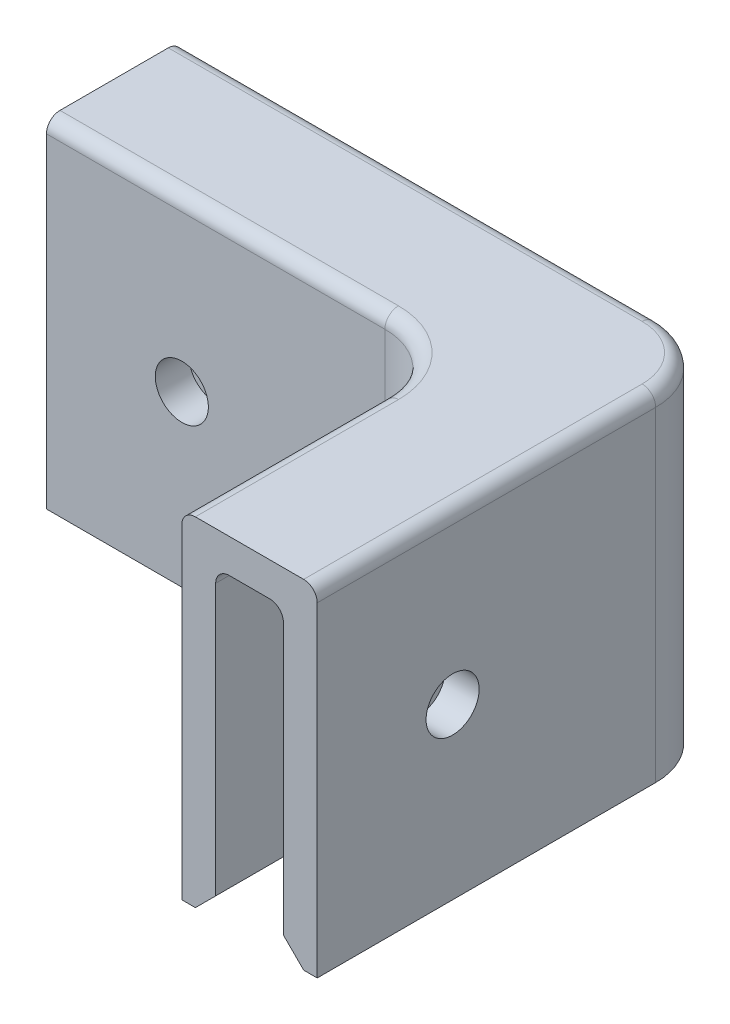
ISO-10303-21;
HEADER;
FILE_DESCRIPTION(('STEP AP214'),'2;1');
FILE_NAME('part.step','',(''),(''),'','','');
FILE_SCHEMA(('AUTOMOTIVE_DESIGN { 1 0 10303 214 1 1 1 1 }'));
ENDSEC;
DATA;
#1=APPLICATION_CONTEXT('core data for automotive mechanical design processes');
#2=APPLICATION_PROTOCOL_DEFINITION('international standard','automotive_design',2000,#1);
#3=PRODUCT_CONTEXT('',#1,'mechanical');
#4=PRODUCT('Part','Part','',(#3));
#5=PRODUCT_RELATED_PRODUCT_CATEGORY('part','',(#4));
#6=PRODUCT_DEFINITION_FORMATION('','',#4);
#7=PRODUCT_DEFINITION_CONTEXT('part definition',#1,'design');
#8=PRODUCT_DEFINITION('design','',#6,#7);
#9=PRODUCT_DEFINITION_SHAPE('','',#8);
#10=(LENGTH_UNIT() NAMED_UNIT(*) SI_UNIT(.MILLI.,.METRE.));
#11=(NAMED_UNIT(*) PLANE_ANGLE_UNIT() SI_UNIT($,.RADIAN.));
#12=(NAMED_UNIT(*) SI_UNIT($,.STERADIAN.) SOLID_ANGLE_UNIT());
#13=UNCERTAINTY_MEASURE_WITH_UNIT(LENGTH_MEASURE(1.E-05),#10,'distance_accuracy_value','');
#14=(GEOMETRIC_REPRESENTATION_CONTEXT(3) GLOBAL_UNCERTAINTY_ASSIGNED_CONTEXT((#13)) GLOBAL_UNIT_ASSIGNED_CONTEXT((#10,
#11,#12)) REPRESENTATION_CONTEXT('',''));
#15=CARTESIAN_POINT('',(0.,0.,0.));
#16=DIRECTION('',(0.,0.,1.));
#17=DIRECTION('',(1.,0.,0.));
#18=AXIS2_PLACEMENT_3D('',#15,#16,#17);
#19=CARTESIAN_POINT('',(0.,0.,0.));
#20=DIRECTION('',(0.,-1.,0.));
#21=DIRECTION('',(0.,0.,-1.));
#22=AXIS2_PLACEMENT_3D('',#19,#20,#21);
#23=PLANE('',#22);
#24=CARTESIAN_POINT('',(-6.35,0.,6.35));
#25=DIRECTION('',(0.,-1.,0.));
#26=DIRECTION('',(0.,0.,-1.));
#27=AXIS2_PLACEMENT_3D('',#24,#25,#26);
#28=CIRCLE('',#27,5.08);
#29=CARTESIAN_POINT('',(-1.27,0.,6.35));
#30=VERTEX_POINT('',#29);
#31=CARTESIAN_POINT('',(-6.35,0.,1.27));
#32=VERTEX_POINT('',#31);
#33=EDGE_CURVE('E298',#30,#32,#28,.F.);
#34=ORIENTED_EDGE('',*,*,#33,.T.);
#35=DIRECTION('',(-1.,0.,0.));
#36=VECTOR('',#35,1.);
#37=CARTESIAN_POINT('',(0.,0.,1.27));
#38=LINE('',#37,#36);
#39=CARTESIAN_POINT('',(-50.8,0.,1.27));
#40=VERTEX_POINT('',#39);
#41=EDGE_CURVE('E253',#32,#40,#38,.T.);
#42=ORIENTED_EDGE('',*,*,#41,.T.);
#43=DIRECTION('',(0.,0.,1.));
#44=VECTOR('',#43,1.);
#45=CARTESIAN_POINT('',(-50.8,0.,12.7));
#46=LINE('',#45,#44);
#47=CARTESIAN_POINT('',(-50.8,0.,0.));
#48=VERTEX_POINT('',#47);
#49=EDGE_CURVE('E235',#48,#40,#46,.T.);
#50=ORIENTED_EDGE('',*,*,#49,.F.);
#51=DIRECTION('',(-1.,0.,0.));
#52=VECTOR('',#51,1.);
#53=CARTESIAN_POINT('',(-50.8,0.,0.));
#54=LINE('',#53,#52);
#55=CARTESIAN_POINT('',(-6.35,0.,0.));
#56=VERTEX_POINT('',#55);
#57=EDGE_CURVE('E243',#56,#48,#54,.T.);
#58=ORIENTED_EDGE('',*,*,#57,.F.);
#59=CARTESIAN_POINT('',(-6.35,0.,6.35));
#60=DIRECTION('',(0.,-1.,0.));
#61=DIRECTION('',(0.,0.,-1.));
#62=AXIS2_PLACEMENT_3D('',#59,#60,#61);
#63=CIRCLE('',#62,6.35);
#64=CARTESIAN_POINT('',(0.,0.,6.35));
#65=VERTEX_POINT('',#64);
#66=EDGE_CURVE('E279',#56,#65,#63,.T.);
#67=ORIENTED_EDGE('',*,*,#66,.T.);
#68=DIRECTION('',(0.,0.,-1.));
#69=VECTOR('',#68,1.);
#70=CARTESIAN_POINT('',(0.,0.,0.));
#71=LINE('',#70,#69);
#72=CARTESIAN_POINT('',(0.,0.,38.1));
#73=VERTEX_POINT('',#72);
#74=EDGE_CURVE('E268',#73,#65,#71,.T.);
#75=ORIENTED_EDGE('',*,*,#74,.F.);
#76=DIRECTION('',(1.,0.,0.));
#77=VECTOR('',#76,1.);
#78=CARTESIAN_POINT('',(0.,0.,38.1));
#79=LINE('',#78,#77);
#80=CARTESIAN_POINT('',(-1.26999999999999,0.,38.1));
#81=VERTEX_POINT('',#80);
#82=EDGE_CURVE('E264',#81,#73,#79,.T.);
#83=ORIENTED_EDGE('',*,*,#82,.F.);
#84=DIRECTION('',(0.,0.,-1.));
#85=VECTOR('',#84,1.);
#86=CARTESIAN_POINT('',(-1.27,0.,0.));
#87=LINE('',#86,#85);
#88=EDGE_CURVE('E291',#81,#30,#87,.T.);
#89=ORIENTED_EDGE('',*,*,#88,.T.);
#90=EDGE_LOOP('',(#34,#42,#50,#58,#67,#75,#83,#89));
#91=FACE_BOUND('',#90,.T.);
#92=ADVANCED_FACE('F41',(#91),#23,.T.);
#93=CARTESIAN_POINT('',(-50.8,0.,11.43));
#94=VERTEX_POINT('',#93);
#95=CARTESIAN_POINT('',(-50.8,0.,12.7));
#96=VERTEX_POINT('',#95);
#97=EDGE_CURVE('E248',#94,#96,#46,.T.);
#98=ORIENTED_EDGE('',*,*,#97,.F.);
#99=DIRECTION('',(1.,0.,0.));
#100=VECTOR('',#99,1.);
#101=CARTESIAN_POINT('',(0.,0.,11.43));
#102=LINE('',#101,#100);
#103=CARTESIAN_POINT('',(-19.05,0.,11.43));
#104=VERTEX_POINT('',#103);
#105=EDGE_CURVE('E322',#94,#104,#102,.T.);
#106=ORIENTED_EDGE('',*,*,#105,.T.);
#107=CARTESIAN_POINT('',(-19.05,0.,19.05));
#108=DIRECTION('',(0.,-1.,0.));
#109=DIRECTION('',(0.,0.,-1.));
#110=AXIS2_PLACEMENT_3D('',#107,#108,#109);
#111=CIRCLE('',#110,7.61999999999999);
#112=CARTESIAN_POINT('',(-11.43,0.,19.05));
#113=VERTEX_POINT('',#112);
#114=EDGE_CURVE('E320',#104,#113,#111,.T.);
#115=ORIENTED_EDGE('',*,*,#114,.T.);
#116=DIRECTION('',(0.,0.,1.));
#117=VECTOR('',#116,1.);
#118=CARTESIAN_POINT('',(-11.43,0.,0.));
#119=LINE('',#118,#117);
#120=CARTESIAN_POINT('',(-11.43,0.,38.1));
#121=VERTEX_POINT('',#120);
#122=EDGE_CURVE('E318',#113,#121,#119,.T.);
#123=ORIENTED_EDGE('',*,*,#122,.T.);
#124=CARTESIAN_POINT('',(-12.7,0.,38.1));
#125=VERTEX_POINT('',#124);
#126=EDGE_CURVE('E265',#125,#121,#79,.T.);
#127=ORIENTED_EDGE('',*,*,#126,.F.);
#128=DIRECTION('',(0.,0.,1.));
#129=VECTOR('',#128,1.);
#130=CARTESIAN_POINT('',(-12.7,0.,38.1));
#131=LINE('',#130,#129);
#132=CARTESIAN_POINT('',(-12.7,0.,19.05));
#133=VERTEX_POINT('',#132);
#134=EDGE_CURVE('E257',#133,#125,#131,.T.);
#135=ORIENTED_EDGE('',*,*,#134,.F.);
#136=CARTESIAN_POINT('',(-19.05,0.,19.05));
#137=DIRECTION('',(0.,-1.,0.));
#138=DIRECTION('',(0.,0.,-1.));
#139=AXIS2_PLACEMENT_3D('',#136,#137,#138);
#140=CIRCLE('',#139,6.35);
#141=CARTESIAN_POINT('',(-19.05,0.,12.7));
#142=VERTEX_POINT('',#141);
#143=EDGE_CURVE('E289',#133,#142,#140,.F.);
#144=ORIENTED_EDGE('',*,*,#143,.T.);
#145=DIRECTION('',(1.,0.,0.));
#146=VECTOR('',#145,1.);
#147=CARTESIAN_POINT('',(-12.7,0.,12.7));
#148=LINE('',#147,#146);
#149=EDGE_CURVE('E254',#96,#142,#148,.T.);
#150=ORIENTED_EDGE('',*,*,#149,.F.);
#151=EDGE_LOOP('',(#98,#106,#115,#123,#127,#135,#144,#150));
#152=FACE_BOUND('',#151,.T.);
#153=ADVANCED_FACE('F506',(#152),#23,.T.);
#154=CARTESIAN_POINT('',(-50.8,31.75,0.));
#155=DIRECTION('',(0.,0.,1.));
#156=DIRECTION('',(1.,0.,0.));
#157=AXIS2_PLACEMENT_3D('',#154,#155,#156);
#158=PLANE('',#157);
#159=CARTESIAN_POINT('',(-38.1,15.875,0.));
#160=DIRECTION('',(0.,0.,1.));
#161=DIRECTION('',(1.,0.,0.));
#162=AXIS2_PLACEMENT_3D('',#159,#160,#161);
#163=CIRCLE('',#162,2.4892);
#164=CARTESIAN_POINT('',(-35.6108,15.875,0.));
#165=VERTEX_POINT('',#164);
#166=EDGE_CURVE('E296',#165,#165,#163,.T.);
#167=ORIENTED_EDGE('',*,*,#166,.T.);
#168=EDGE_LOOP('',(#167));
#169=FACE_BOUND('',#168,.T.);
#170=DIRECTION('',(0.,-1.,0.));
#171=VECTOR('',#170,1.);
#172=CARTESIAN_POINT('',(-50.8,31.75,0.));
#173=LINE('',#172,#171);
#174=CARTESIAN_POINT('',(-50.8,30.48,0.));
#175=VERTEX_POINT('',#174);
#176=EDGE_CURVE('E229',#175,#48,#173,.T.);
#177=ORIENTED_EDGE('',*,*,#176,.F.);
#178=DIRECTION('',(-1.,0.,0.));
#179=VECTOR('',#178,1.);
#180=CARTESIAN_POINT('',(-50.8,30.48,0.));
#181=LINE('',#180,#179);
#182=CARTESIAN_POINT('',(-6.35,30.48,0.));
#183=VERTEX_POINT('',#182);
#184=EDGE_CURVE('E363',#175,#183,#181,.F.);
#185=ORIENTED_EDGE('',*,*,#184,.T.);
#186=DIRECTION('',(0.,-1.,0.));
#187=VECTOR('',#186,1.);
#188=CARTESIAN_POINT('',(-6.35,31.75,0.));
#189=LINE('',#188,#187);
#190=EDGE_CURVE('E239',#183,#56,#189,.T.);
#191=ORIENTED_EDGE('',*,*,#190,.T.);
#192=ORIENTED_EDGE('',*,*,#57,.T.);
#193=EDGE_LOOP('',(#177,#185,#191,#192));
#194=FACE_BOUND('',#193,.T.);
#195=ADVANCED_FACE('F244',(#169,#194),#158,.F.);
#196=CARTESIAN_POINT('',(-50.8,31.75,12.7));
#197=DIRECTION('',(1.,0.,0.));
#198=DIRECTION('',(0.,0.,-1.));
#199=AXIS2_PLACEMENT_3D('',#196,#197,#198);
#200=PLANE('',#199);
#201=DIRECTION('',(0.,0.,1.));
#202=VECTOR('',#201,1.);
#203=CARTESIAN_POINT('',(-50.8,31.75,12.7));
#204=LINE('',#203,#202);
#205=CARTESIAN_POINT('',(-50.8,31.75,1.27));
#206=VERTEX_POINT('',#205);
#207=CARTESIAN_POINT('',(-50.8,31.75,11.43));
#208=VERTEX_POINT('',#207);
#209=EDGE_CURVE('E271',#206,#208,#204,.T.);
#210=ORIENTED_EDGE('',*,*,#209,.F.);
#211=CARTESIAN_POINT('',(-50.8,30.48,1.27));
#212=DIRECTION('',(1.,0.,0.));
#213=DIRECTION('',(0.,0.,-1.));
#214=AXIS2_PLACEMENT_3D('',#211,#212,#213);
#215=CIRCLE('',#214,1.27);
#216=EDGE_CURVE('E236',#206,#175,#215,.F.);
#217=ORIENTED_EDGE('',*,*,#216,.T.);
#218=ORIENTED_EDGE('',*,*,#176,.T.);
#219=ORIENTED_EDGE('',*,*,#49,.T.);
#220=DIRECTION('',(0.,-0.707106781186549,-0.707106781186546));
#221=VECTOR('',#220,1.);
#222=CARTESIAN_POINT('',(-50.8,0.,1.27));
#223=LINE('',#222,#221);
#224=CARTESIAN_POINT('',(-50.8,1.90500000000001,3.175));
#225=VERTEX_POINT('',#224);
#226=EDGE_CURVE('E303',#40,#225,#223,.F.);
#227=ORIENTED_EDGE('',*,*,#226,.T.);
#228=DIRECTION('',(0.,-1.,0.));
#229=VECTOR('',#228,1.);
#230=CARTESIAN_POINT('',(-50.8,31.75,3.175));
#231=LINE('',#230,#229);
#232=CARTESIAN_POINT('',(-50.8,27.305,3.175));
#233=VERTEX_POINT('',#232);
#234=EDGE_CURVE('E459',#233,#225,#231,.T.);
#235=ORIENTED_EDGE('',*,*,#234,.F.);
#236=CARTESIAN_POINT('',(-50.8,27.305,4.445));
#237=DIRECTION('',(1.,0.,0.));
#238=DIRECTION('',(0.,0.,-1.));
#239=AXIS2_PLACEMENT_3D('',#236,#237,#238);
#240=CIRCLE('',#239,1.27);
#241=CARTESIAN_POINT('',(-50.8,28.575,4.445));
#242=VERTEX_POINT('',#241);
#243=EDGE_CURVE('E403',#233,#242,#240,.T.);
#244=ORIENTED_EDGE('',*,*,#243,.T.);
#245=DIRECTION('',(0.,0.,1.));
#246=VECTOR('',#245,1.);
#247=CARTESIAN_POINT('',(-50.8,28.575,0.));
#248=LINE('',#247,#246);
#249=CARTESIAN_POINT('',(-50.8,28.575,8.255));
#250=VERTEX_POINT('',#249);
#251=EDGE_CURVE('E449',#242,#250,#248,.T.);
#252=ORIENTED_EDGE('',*,*,#251,.T.);
#253=CARTESIAN_POINT('',(-50.8,27.305,8.255));
#254=DIRECTION('',(1.,0.,0.));
#255=DIRECTION('',(0.,0.,-1.));
#256=AXIS2_PLACEMENT_3D('',#253,#254,#255);
#257=CIRCLE('',#256,1.27);
#258=CARTESIAN_POINT('',(-50.8,27.305,9.525));
#259=VERTEX_POINT('',#258);
#260=EDGE_CURVE('E405',#250,#259,#257,.T.);
#261=ORIENTED_EDGE('',*,*,#260,.T.);
#262=DIRECTION('',(0.,-1.,0.));
#263=VECTOR('',#262,1.);
#264=CARTESIAN_POINT('',(-50.8,31.75,9.525));
#265=LINE('',#264,#263);
#266=CARTESIAN_POINT('',(-50.8,1.90500000000002,9.525));
#267=VERTEX_POINT('',#266);
#268=EDGE_CURVE('E458',#259,#267,#265,.T.);
#269=ORIENTED_EDGE('',*,*,#268,.T.);
#270=DIRECTION('',(0.,0.707106781186549,-0.707106781186546));
#271=VECTOR('',#270,1.);
#272=CARTESIAN_POINT('',(-50.8,0.,11.43));
#273=LINE('',#272,#271);
#274=EDGE_CURVE('E301',#267,#94,#273,.F.);
#275=ORIENTED_EDGE('',*,*,#274,.T.);
#276=ORIENTED_EDGE('',*,*,#97,.T.);
#277=DIRECTION('',(0.,-1.,0.));
#278=VECTOR('',#277,1.);
#279=CARTESIAN_POINT('',(-50.8,31.75,12.7));
#280=LINE('',#279,#278);
#281=CARTESIAN_POINT('',(-50.8,30.48,12.7));
#282=VERTEX_POINT('',#281);
#283=EDGE_CURVE('E240',#282,#96,#280,.T.);
#284=ORIENTED_EDGE('',*,*,#283,.F.);
#285=CARTESIAN_POINT('',(-50.8,30.48,11.43));
#286=DIRECTION('',(1.,0.,0.));
#287=DIRECTION('',(0.,0.,-1.));
#288=AXIS2_PLACEMENT_3D('',#285,#286,#287);
#289=CIRCLE('',#288,1.27);
#290=EDGE_CURVE('E360',#282,#208,#289,.F.);
#291=ORIENTED_EDGE('',*,*,#290,.T.);
#292=EDGE_LOOP('',(#210,#217,#218,#219,#227,#235,#244,#252,#261,#269,#275,#276,#284,#291));
#293=FACE_BOUND('',#292,.T.);
#294=ADVANCED_FACE('F232',(#293),#200,.F.);
#295=CARTESIAN_POINT('',(-12.7,31.75,12.7));
#296=DIRECTION('',(0.,0.,-1.));
#297=DIRECTION('',(-1.,0.,0.));
#298=AXIS2_PLACEMENT_3D('',#295,#296,#297);
#299=PLANE('',#298);
#300=CARTESIAN_POINT('',(-38.1,15.875,12.7));
#301=DIRECTION('',(0.,0.,1.));
#302=DIRECTION('',(1.,0.,0.));
#303=AXIS2_PLACEMENT_3D('',#300,#301,#302);
#304=CIRCLE('',#303,2.48919999999999);
#305=CARTESIAN_POINT('',(-35.6108,15.875,12.7));
#306=VERTEX_POINT('',#305);
#307=EDGE_CURVE('E341',#306,#306,#304,.T.);
#308=ORIENTED_EDGE('',*,*,#307,.F.);
#309=EDGE_LOOP('',(#308));
#310=FACE_BOUND('',#309,.T.);
#311=DIRECTION('',(0.,-1.,0.));
#312=VECTOR('',#311,1.);
#313=CARTESIAN_POINT('',(-19.05,31.75,12.7));
#314=LINE('',#313,#312);
#315=CARTESIAN_POINT('',(-19.05,30.48,12.7));
#316=VERTEX_POINT('',#315);
#317=EDGE_CURVE('E286',#142,#316,#314,.F.);
#318=ORIENTED_EDGE('',*,*,#317,.T.);
#319=DIRECTION('',(1.,0.,0.));
#320=VECTOR('',#319,1.);
#321=CARTESIAN_POINT('',(-12.7,30.48,12.7));
#322=LINE('',#321,#320);
#323=EDGE_CURVE('E367',#316,#282,#322,.F.);
#324=ORIENTED_EDGE('',*,*,#323,.T.);
#325=ORIENTED_EDGE('',*,*,#283,.T.);
#326=ORIENTED_EDGE('',*,*,#149,.T.);
#327=EDGE_LOOP('',(#318,#324,#325,#326));
#328=FACE_BOUND('',#327,.T.);
#329=ADVANCED_FACE('F502',(#310,#328),#299,.F.);
#330=CARTESIAN_POINT('',(-12.7,31.75,38.1));
#331=DIRECTION('',(1.,0.,0.));
#332=DIRECTION('',(0.,0.,-1.));
#333=AXIS2_PLACEMENT_3D('',#330,#331,#332);
#334=PLANE('',#333);
#335=CARTESIAN_POINT('',(-12.7,15.875,25.4));
#336=DIRECTION('',(-1.,0.,0.));
#337=DIRECTION('',(0.,0.,1.));
#338=AXIS2_PLACEMENT_3D('',#335,#336,#337);
#339=CIRCLE('',#338,2.4892);
#340=CARTESIAN_POINT('',(-12.7,15.875,27.8892));
#341=VERTEX_POINT('',#340);
#342=EDGE_CURVE('E537',#341,#341,#339,.T.);
#343=ORIENTED_EDGE('',*,*,#342,.F.);
#344=EDGE_LOOP('',(#343));
#345=FACE_BOUND('',#344,.T.);
#346=DIRECTION('',(0.,-1.,0.));
#347=VECTOR('',#346,1.);
#348=CARTESIAN_POINT('',(-12.7,31.75,38.1));
#349=LINE('',#348,#347);
#350=CARTESIAN_POINT('',(-12.7,30.48,38.1));
#351=VERTEX_POINT('',#350);
#352=EDGE_CURVE('E274',#351,#125,#349,.T.);
#353=ORIENTED_EDGE('',*,*,#352,.F.);
#354=DIRECTION('',(0.,0.,1.));
#355=VECTOR('',#354,1.);
#356=CARTESIAN_POINT('',(-12.7,30.48,38.1));
#357=LINE('',#356,#355);
#358=CARTESIAN_POINT('',(-12.7,30.48,19.05));
#359=VERTEX_POINT('',#358);
#360=EDGE_CURVE('E398',#351,#359,#357,.F.);
#361=ORIENTED_EDGE('',*,*,#360,.T.);
#362=DIRECTION('',(0.,-1.,0.));
#363=VECTOR('',#362,1.);
#364=CARTESIAN_POINT('',(-12.7,0.,19.05));
#365=LINE('',#364,#363);
#366=EDGE_CURVE('E284',#359,#133,#365,.T.);
#367=ORIENTED_EDGE('',*,*,#366,.T.);
#368=ORIENTED_EDGE('',*,*,#134,.T.);
#369=EDGE_LOOP('',(#353,#361,#367,#368));
#370=FACE_BOUND('',#369,.T.);
#371=ADVANCED_FACE('F511',(#345,#370),#334,.F.);
#372=CARTESIAN_POINT('',(0.,31.75,38.1));
#373=DIRECTION('',(0.,0.,-1.));
#374=DIRECTION('',(-1.,0.,0.));
#375=AXIS2_PLACEMENT_3D('',#372,#373,#374);
#376=PLANE('',#375);
#377=DIRECTION('',(0.,-1.,0.));
#378=VECTOR('',#377,1.);
#379=CARTESIAN_POINT('',(0.,31.75,38.1));
#380=LINE('',#379,#378);
#381=CARTESIAN_POINT('',(0.,30.48,38.1));
#382=VERTEX_POINT('',#381);
#383=EDGE_CURVE('E272',#382,#73,#380,.T.);
#384=ORIENTED_EDGE('',*,*,#383,.F.);
#385=CARTESIAN_POINT('',(-1.27,30.48,38.1));
#386=DIRECTION('',(0.,0.,-1.));
#387=DIRECTION('',(-1.,0.,0.));
#388=AXIS2_PLACEMENT_3D('',#385,#386,#387);
#389=CIRCLE('',#388,1.27);
#390=CARTESIAN_POINT('',(-1.27,31.75,38.1));
#391=VERTEX_POINT('',#390);
#392=EDGE_CURVE('E396',#382,#391,#389,.F.);
#393=ORIENTED_EDGE('',*,*,#392,.T.);
#394=DIRECTION('',(1.,0.,0.));
#395=VECTOR('',#394,1.);
#396=CARTESIAN_POINT('',(0.,31.75,38.1));
#397=LINE('',#396,#395);
#398=CARTESIAN_POINT('',(-11.43,31.75,38.1));
#399=VERTEX_POINT('',#398);
#400=EDGE_CURVE('E275',#399,#391,#397,.T.);
#401=ORIENTED_EDGE('',*,*,#400,.F.);
#402=CARTESIAN_POINT('',(-11.43,30.48,38.1));
#403=DIRECTION('',(0.,0.,-1.));
#404=DIRECTION('',(-1.,0.,0.));
#405=AXIS2_PLACEMENT_3D('',#402,#403,#404);
#406=CIRCLE('',#405,1.27);
#407=EDGE_CURVE('E66',#399,#351,#406,.F.);
#408=ORIENTED_EDGE('',*,*,#407,.T.);
#409=ORIENTED_EDGE('',*,*,#352,.T.);
#410=ORIENTED_EDGE('',*,*,#126,.T.);
#411=DIRECTION('',(-0.707106781186546,-0.707106781186549,0.));
#412=VECTOR('',#411,1.);
#413=CARTESIAN_POINT('',(-11.43,0.,38.1));
#414=LINE('',#413,#412);
#415=CARTESIAN_POINT('',(-9.525,1.90500000000002,38.1));
#416=VERTEX_POINT('',#415);
#417=EDGE_CURVE('E313',#121,#416,#414,.F.);
#418=ORIENTED_EDGE('',*,*,#417,.T.);
#419=DIRECTION('',(0.,-1.,0.));
#420=VECTOR('',#419,1.);
#421=CARTESIAN_POINT('',(-9.525,31.75,38.1));
#422=LINE('',#421,#420);
#423=CARTESIAN_POINT('',(-9.525,27.305,38.1));
#424=VERTEX_POINT('',#423);
#425=EDGE_CURVE('E443',#424,#416,#422,.T.);
#426=ORIENTED_EDGE('',*,*,#425,.F.);
#427=CARTESIAN_POINT('',(-8.255,27.305,38.1));
#428=DIRECTION('',(0.,0.,-1.));
#429=DIRECTION('',(-1.,0.,0.));
#430=AXIS2_PLACEMENT_3D('',#427,#428,#429);
#431=CIRCLE('',#430,1.27);
#432=CARTESIAN_POINT('',(-8.255,28.575,38.1));
#433=VERTEX_POINT('',#432);
#434=EDGE_CURVE('E11',#424,#433,#431,.T.);
#435=ORIENTED_EDGE('',*,*,#434,.T.);
#436=DIRECTION('',(1.,0.,0.));
#437=VECTOR('',#436,1.);
#438=CARTESIAN_POINT('',(0.,28.575,38.1));
#439=LINE('',#438,#437);
#440=CARTESIAN_POINT('',(-4.445,28.575,38.1));
#441=VERTEX_POINT('',#440);
#442=EDGE_CURVE('E441',#433,#441,#439,.T.);
#443=ORIENTED_EDGE('',*,*,#442,.T.);
#444=CARTESIAN_POINT('',(-4.445,27.305,38.1));
#445=DIRECTION('',(0.,0.,-1.));
#446=DIRECTION('',(-1.,0.,0.));
#447=AXIS2_PLACEMENT_3D('',#444,#445,#446);
#448=CIRCLE('',#447,1.27);
#449=CARTESIAN_POINT('',(-3.17499999999999,27.305,38.1));
#450=VERTEX_POINT('',#449);
#451=EDGE_CURVE('E50',#441,#450,#448,.T.);
#452=ORIENTED_EDGE('',*,*,#451,.T.);
#453=DIRECTION('',(0.,-1.,0.));
#454=VECTOR('',#453,1.);
#455=CARTESIAN_POINT('',(-3.17499999999999,31.75,38.1));
#456=LINE('',#455,#454);
#457=CARTESIAN_POINT('',(-3.17499999999999,1.90500000000001,38.1));
#458=VERTEX_POINT('',#457);
#459=EDGE_CURVE('E448',#450,#458,#456,.T.);
#460=ORIENTED_EDGE('',*,*,#459,.T.);
#461=DIRECTION('',(-0.707106781186546,0.707106781186549,0.));
#462=VECTOR('',#461,1.);
#463=CARTESIAN_POINT('',(-1.27,0.,38.1));
#464=LINE('',#463,#462);
#465=EDGE_CURVE('E316',#458,#81,#464,.F.);
#466=ORIENTED_EDGE('',*,*,#465,.T.);
#467=ORIENTED_EDGE('',*,*,#82,.T.);
#468=EDGE_LOOP('',(#384,#393,#401,#408,#409,#410,#418,#426,#435,#443,#452,#460,#466,#467));
#469=FACE_BOUND('',#468,.T.);
#470=ADVANCED_FACE('F440',(#469),#376,.F.);
#471=CARTESIAN_POINT('',(0.,31.75,0.));
#472=DIRECTION('',(-1.,0.,0.));
#473=DIRECTION('',(0.,0.,1.));
#474=AXIS2_PLACEMENT_3D('',#471,#472,#473);
#475=PLANE('',#474);
#476=CARTESIAN_POINT('',(0.,15.875,25.4));
#477=DIRECTION('',(-1.,0.,0.));
#478=DIRECTION('',(0.,0.,1.));
#479=AXIS2_PLACEMENT_3D('',#476,#477,#478);
#480=CIRCLE('',#479,2.4892);
#481=CARTESIAN_POINT('',(0.,15.875,27.8892));
#482=VERTEX_POINT('',#481);
#483=EDGE_CURVE('E534',#482,#482,#480,.T.);
#484=ORIENTED_EDGE('',*,*,#483,.T.);
#485=EDGE_LOOP('',(#484));
#486=FACE_BOUND('',#485,.T.);
#487=DIRECTION('',(0.,-1.,0.));
#488=VECTOR('',#487,1.);
#489=CARTESIAN_POINT('',(0.,31.75,6.35));
#490=LINE('',#489,#488);
#491=CARTESIAN_POINT('',(0.,30.48,6.35));
#492=VERTEX_POINT('',#491);
#493=EDGE_CURVE('E281',#65,#492,#490,.F.);
#494=ORIENTED_EDGE('',*,*,#493,.T.);
#495=DIRECTION('',(0.,0.,-1.));
#496=VECTOR('',#495,1.);
#497=CARTESIAN_POINT('',(0.,30.48,0.));
#498=LINE('',#497,#496);
#499=EDGE_CURVE('E393',#492,#382,#498,.F.);
#500=ORIENTED_EDGE('',*,*,#499,.T.);
#501=ORIENTED_EDGE('',*,*,#383,.T.);
#502=ORIENTED_EDGE('',*,*,#74,.T.);
#503=EDGE_LOOP('',(#494,#500,#501,#502));
#504=FACE_BOUND('',#503,.T.);
#505=ADVANCED_FACE('F567',(#486,#504),#475,.F.);
#506=CARTESIAN_POINT('',(0.,31.75,0.));
#507=DIRECTION('',(0.,-1.,0.));
#508=DIRECTION('',(0.,0.,-1.));
#509=AXIS2_PLACEMENT_3D('',#506,#507,#508);
#510=PLANE('',#509);
#511=CARTESIAN_POINT('',(-6.35,31.75,6.35));
#512=DIRECTION('',(0.,-1.,0.));
#513=DIRECTION('',(0.,0.,-1.));
#514=AXIS2_PLACEMENT_3D('',#511,#512,#513);
#515=CIRCLE('',#514,5.08);
#516=CARTESIAN_POINT('',(-1.27,31.75,6.35));
#517=VERTEX_POINT('',#516);
#518=CARTESIAN_POINT('',(-6.35,31.75,1.27));
#519=VERTEX_POINT('',#518);
#520=EDGE_CURVE('E355',#517,#519,#515,.F.);
#521=ORIENTED_EDGE('',*,*,#520,.T.);
#522=DIRECTION('',(-1.,0.,0.));
#523=VECTOR('',#522,1.);
#524=CARTESIAN_POINT('',(0.,31.75,1.27));
#525=LINE('',#524,#523);
#526=EDGE_CURVE('E357',#519,#206,#525,.T.);
#527=ORIENTED_EDGE('',*,*,#526,.T.);
#528=ORIENTED_EDGE('',*,*,#209,.T.);
#529=DIRECTION('',(1.,0.,0.));
#530=VECTOR('',#529,1.);
#531=CARTESIAN_POINT('',(0.,31.75,11.43));
#532=LINE('',#531,#530);
#533=CARTESIAN_POINT('',(-19.05,31.75,11.43));
#534=VERTEX_POINT('',#533);
#535=EDGE_CURVE('E350',#208,#534,#532,.T.);
#536=ORIENTED_EDGE('',*,*,#535,.T.);
#537=CARTESIAN_POINT('',(-19.05,31.75,19.05));
#538=DIRECTION('',(0.,-1.,0.));
#539=DIRECTION('',(0.,0.,-1.));
#540=AXIS2_PLACEMENT_3D('',#537,#538,#539);
#541=CIRCLE('',#540,7.62);
#542=CARTESIAN_POINT('',(-11.43,31.75,19.05));
#543=VERTEX_POINT('',#542);
#544=EDGE_CURVE('E348',#534,#543,#541,.T.);
#545=ORIENTED_EDGE('',*,*,#544,.T.);
#546=DIRECTION('',(0.,0.,1.));
#547=VECTOR('',#546,1.);
#548=CARTESIAN_POINT('',(-11.43,31.75,0.));
#549=LINE('',#548,#547);
#550=EDGE_CURVE('E333',#543,#399,#549,.T.);
#551=ORIENTED_EDGE('',*,*,#550,.T.);
#552=ORIENTED_EDGE('',*,*,#400,.T.);
#553=DIRECTION('',(0.,0.,-1.));
#554=VECTOR('',#553,1.);
#555=CARTESIAN_POINT('',(-1.27,31.75,0.));
#556=LINE('',#555,#554);
#557=EDGE_CURVE('E353',#391,#517,#556,.T.);
#558=ORIENTED_EDGE('',*,*,#557,.T.);
#559=EDGE_LOOP('',(#521,#527,#528,#536,#545,#551,#552,#558));
#560=FACE_BOUND('',#559,.T.);
#561=ADVANCED_FACE('F467',(#560),#510,.F.);
#562=CARTESIAN_POINT('',(-6.35,31.75,6.35));
#563=DIRECTION('',(0.,-1.,0.));
#564=DIRECTION('',(0.,0.,-1.));
#565=AXIS2_PLACEMENT_3D('',#562,#563,#564);
#566=CYLINDRICAL_SURFACE('',#565,6.35);
#567=ORIENTED_EDGE('',*,*,#190,.F.);
#568=CARTESIAN_POINT('',(-6.35,30.48,6.35));
#569=DIRECTION('',(0.,-1.,0.));
#570=DIRECTION('',(0.,0.,-1.));
#571=AXIS2_PLACEMENT_3D('',#568,#569,#570);
#572=CIRCLE('',#571,6.35);
#573=EDGE_CURVE('E365',#183,#492,#572,.T.);
#574=ORIENTED_EDGE('',*,*,#573,.T.);
#575=ORIENTED_EDGE('',*,*,#493,.F.);
#576=ORIENTED_EDGE('',*,*,#66,.F.);
#577=EDGE_LOOP('',(#567,#574,#575,#576));
#578=FACE_BOUND('',#577,.T.);
#579=ADVANCED_FACE('F588',(#578),#566,.T.);
#580=CARTESIAN_POINT('',(-19.05,31.75,19.05));
#581=DIRECTION('',(0.,1.,0.));
#582=DIRECTION('',(0.,0.,1.));
#583=AXIS2_PLACEMENT_3D('',#580,#581,#582);
#584=CYLINDRICAL_SURFACE('',#583,6.35);
#585=ORIENTED_EDGE('',*,*,#366,.F.);
#586=CARTESIAN_POINT('',(-19.05,30.48,19.05));
#587=DIRECTION('',(0.,-1.,0.));
#588=DIRECTION('',(0.,0.,-1.));
#589=AXIS2_PLACEMENT_3D('',#586,#587,#588);
#590=CIRCLE('',#589,6.35);
#591=EDGE_CURVE('E369',#359,#316,#590,.F.);
#592=ORIENTED_EDGE('',*,*,#591,.T.);
#593=ORIENTED_EDGE('',*,*,#317,.F.);
#594=ORIENTED_EDGE('',*,*,#143,.F.);
#595=EDGE_LOOP('',(#585,#592,#593,#594));
#596=FACE_BOUND('',#595,.T.);
#597=ADVANCED_FACE('F499',(#596),#584,.F.);
#598=CARTESIAN_POINT('',(-50.8,31.75,3.175));
#599=DIRECTION('',(0.,0.,1.));
#600=DIRECTION('',(1.,0.,0.));
#601=AXIS2_PLACEMENT_3D('',#598,#599,#600);
#602=PLANE('',#601);
#603=CARTESIAN_POINT('',(-38.1,15.875,3.175));
#604=DIRECTION('',(0.,0.,1.));
#605=DIRECTION('',(1.,0.,0.));
#606=AXIS2_PLACEMENT_3D('',#603,#604,#605);
#607=CIRCLE('',#606,2.48919999999999);
#608=CARTESIAN_POINT('',(-35.6108,15.875,3.175));
#609=VERTEX_POINT('',#608);
#610=EDGE_CURVE('E292',#609,#609,#607,.T.);
#611=ORIENTED_EDGE('',*,*,#610,.F.);
#612=EDGE_LOOP('',(#611));
#613=FACE_BOUND('',#612,.T.);
#614=DIRECTION('',(0.,1.,0.));
#615=VECTOR('',#614,1.);
#616=CARTESIAN_POINT('',(-6.35,31.75,3.175));
#617=LINE('',#616,#615);
#618=CARTESIAN_POINT('',(-6.35,27.305,3.175));
#619=VERTEX_POINT('',#618);
#620=CARTESIAN_POINT('',(-6.35,1.90500000000001,3.175));
#621=VERTEX_POINT('',#620);
#622=EDGE_CURVE('E462',#619,#621,#617,.F.);
#623=ORIENTED_EDGE('',*,*,#622,.F.);
#624=DIRECTION('',(-1.,0.,0.));
#625=VECTOR('',#624,1.);
#626=CARTESIAN_POINT('',(-50.8,27.305,3.175));
#627=LINE('',#626,#625);
#628=EDGE_CURVE('E371',#619,#233,#627,.T.);
#629=ORIENTED_EDGE('',*,*,#628,.T.);
#630=ORIENTED_EDGE('',*,*,#234,.T.);
#631=DIRECTION('',(1.,0.,0.));
#632=VECTOR('',#631,1.);
#633=CARTESIAN_POINT('',(-50.8,1.90500000000001,3.175));
#634=LINE('',#633,#632);
#635=EDGE_CURVE('E305',#225,#621,#634,.T.);
#636=ORIENTED_EDGE('',*,*,#635,.T.);
#637=EDGE_LOOP('',(#623,#629,#630,#636));
#638=FACE_BOUND('',#637,.T.);
#639=ADVANCED_FACE('F603',(#613,#638),#602,.T.);
#640=CARTESIAN_POINT('',(-12.7,31.75,9.525));
#641=DIRECTION('',(0.,0.,-1.));
#642=DIRECTION('',(-1.,0.,0.));
#643=AXIS2_PLACEMENT_3D('',#640,#641,#642);
#644=PLANE('',#643);
#645=CARTESIAN_POINT('',(-38.1,15.875,9.525));
#646=DIRECTION('',(0.,0.,-1.));
#647=DIRECTION('',(-1.,0.,0.));
#648=AXIS2_PLACEMENT_3D('',#645,#646,#647);
#649=CIRCLE('',#648,2.48919999999999);
#650=CARTESIAN_POINT('',(-40.5892,15.875,9.525));
#651=VERTEX_POINT('',#650);
#652=EDGE_CURVE('E295',#651,#651,#649,.T.);
#653=ORIENTED_EDGE('',*,*,#652,.F.);
#654=EDGE_LOOP('',(#653));
#655=FACE_BOUND('',#654,.T.);
#656=ORIENTED_EDGE('',*,*,#268,.F.);
#657=DIRECTION('',(1.,0.,0.));
#658=VECTOR('',#657,1.);
#659=CARTESIAN_POINT('',(-19.05,27.305,9.525));
#660=LINE('',#659,#658);
#661=CARTESIAN_POINT('',(-19.05,27.305,9.525));
#662=VERTEX_POINT('',#661);
#663=EDGE_CURVE('E388',#259,#662,#660,.T.);
#664=ORIENTED_EDGE('',*,*,#663,.T.);
#665=DIRECTION('',(0.,1.,0.));
#666=VECTOR('',#665,1.);
#667=CARTESIAN_POINT('',(-19.05,31.75,9.525));
#668=LINE('',#667,#666);
#669=CARTESIAN_POINT('',(-19.05,1.90500000000002,9.525));
#670=VERTEX_POINT('',#669);
#671=EDGE_CURVE('E249',#670,#662,#668,.T.);
#672=ORIENTED_EDGE('',*,*,#671,.F.);
#673=DIRECTION('',(-1.,0.,0.));
#674=VECTOR('',#673,1.);
#675=CARTESIAN_POINT('',(-12.7,1.90500000000002,9.525));
#676=LINE('',#675,#674);
#677=EDGE_CURVE('E325',#670,#267,#676,.T.);
#678=ORIENTED_EDGE('',*,*,#677,.T.);
#679=EDGE_LOOP('',(#656,#664,#672,#678));
#680=FACE_BOUND('',#679,.T.);
#681=ADVANCED_FACE('F612',(#655,#680),#644,.T.);
#682=CARTESIAN_POINT('',(-9.525,31.75,38.1));
#683=DIRECTION('',(1.,0.,0.));
#684=DIRECTION('',(0.,0.,-1.));
#685=AXIS2_PLACEMENT_3D('',#682,#683,#684);
#686=PLANE('',#685);
#687=CARTESIAN_POINT('',(-9.525,15.875,25.4));
#688=DIRECTION('',(1.,0.,0.));
#689=DIRECTION('',(0.,0.,-1.));
#690=AXIS2_PLACEMENT_3D('',#687,#688,#689);
#691=CIRCLE('',#690,2.4892);
#692=CARTESIAN_POINT('',(-9.525,15.875,22.9108));
#693=VERTEX_POINT('',#692);
#694=EDGE_CURVE('E453',#693,#693,#691,.T.);
#695=ORIENTED_EDGE('',*,*,#694,.F.);
#696=EDGE_LOOP('',(#695));
#697=FACE_BOUND('',#696,.T.);
#698=DIRECTION('',(0.,1.,0.));
#699=VECTOR('',#698,1.);
#700=CARTESIAN_POINT('',(-9.525,31.75,19.05));
#701=LINE('',#700,#699);
#702=CARTESIAN_POINT('',(-9.525,27.305,19.05));
#703=VERTEX_POINT('',#702);
#704=CARTESIAN_POINT('',(-9.525,1.90500000000002,19.05));
#705=VERTEX_POINT('',#704);
#706=EDGE_CURVE('E520',#703,#705,#701,.F.);
#707=ORIENTED_EDGE('',*,*,#706,.F.);
#708=DIRECTION('',(0.,0.,1.));
#709=VECTOR('',#708,1.);
#710=CARTESIAN_POINT('',(-9.525,27.305,38.1));
#711=LINE('',#710,#709);
#712=EDGE_CURVE('E58',#703,#424,#711,.T.);
#713=ORIENTED_EDGE('',*,*,#712,.T.);
#714=ORIENTED_EDGE('',*,*,#425,.T.);
#715=DIRECTION('',(0.,0.,-1.));
#716=VECTOR('',#715,1.);
#717=CARTESIAN_POINT('',(-9.525,1.90500000000002,38.1));
#718=LINE('',#717,#716);
#719=EDGE_CURVE('E330',#416,#705,#718,.T.);
#720=ORIENTED_EDGE('',*,*,#719,.T.);
#721=EDGE_LOOP('',(#707,#713,#714,#720));
#722=FACE_BOUND('',#721,.T.);
#723=ADVANCED_FACE('F519',(#697,#722),#686,.T.);
#724=CARTESIAN_POINT('',(-3.175,31.75,0.));
#725=DIRECTION('',(-1.,0.,0.));
#726=DIRECTION('',(0.,0.,1.));
#727=AXIS2_PLACEMENT_3D('',#724,#725,#726);
#728=PLANE('',#727);
#729=CARTESIAN_POINT('',(-3.175,15.875,25.4));
#730=DIRECTION('',(-1.,0.,0.));
#731=DIRECTION('',(0.,0.,1.));
#732=AXIS2_PLACEMENT_3D('',#729,#730,#731);
#733=CIRCLE('',#732,2.4892);
#734=CARTESIAN_POINT('',(-3.17499999999999,15.875,27.8892));
#735=VERTEX_POINT('',#734);
#736=EDGE_CURVE('E531',#735,#735,#733,.T.);
#737=ORIENTED_EDGE('',*,*,#736,.F.);
#738=EDGE_LOOP('',(#737));
#739=FACE_BOUND('',#738,.T.);
#740=ORIENTED_EDGE('',*,*,#459,.F.);
#741=DIRECTION('',(0.,0.,-1.));
#742=VECTOR('',#741,1.);
#743=CARTESIAN_POINT('',(-3.175,27.305,6.35));
#744=LINE('',#743,#742);
#745=CARTESIAN_POINT('',(-3.175,27.305,6.35));
#746=VERTEX_POINT('',#745);
#747=EDGE_CURVE('E400',#450,#746,#744,.T.);
#748=ORIENTED_EDGE('',*,*,#747,.T.);
#749=DIRECTION('',(0.,1.,0.));
#750=VECTOR('',#749,1.);
#751=CARTESIAN_POINT('',(-3.175,31.75,6.35));
#752=LINE('',#751,#750);
#753=CARTESIAN_POINT('',(-3.175,1.90500000000001,6.35));
#754=VERTEX_POINT('',#753);
#755=EDGE_CURVE('E522',#754,#746,#752,.T.);
#756=ORIENTED_EDGE('',*,*,#755,.F.);
#757=DIRECTION('',(0.,0.,1.));
#758=VECTOR('',#757,1.);
#759=CARTESIAN_POINT('',(-3.175,1.90500000000001,0.));
#760=LINE('',#759,#758);
#761=EDGE_CURVE('E310',#754,#458,#760,.T.);
#762=ORIENTED_EDGE('',*,*,#761,.T.);
#763=EDGE_LOOP('',(#740,#748,#756,#762));
#764=FACE_BOUND('',#763,.T.);
#765=ADVANCED_FACE('F630',(#739,#764),#728,.T.);
#766=CARTESIAN_POINT('',(0.,28.575,0.));
#767=DIRECTION('',(0.,-1.,0.));
#768=DIRECTION('',(0.,0.,-1.));
#769=AXIS2_PLACEMENT_3D('',#766,#767,#768);
#770=PLANE('',#769);
#771=ORIENTED_EDGE('',*,*,#251,.F.);
#772=DIRECTION('',(-1.,0.,0.));
#773=VECTOR('',#772,1.);
#774=CARTESIAN_POINT('',(-6.35,28.575,4.445));
#775=LINE('',#774,#773);
#776=CARTESIAN_POINT('',(-6.35,28.575,4.445));
#777=VERTEX_POINT('',#776);
#778=EDGE_CURVE('E384',#242,#777,#775,.F.);
#779=ORIENTED_EDGE('',*,*,#778,.T.);
#780=CARTESIAN_POINT('',(-6.35,28.575,6.35));
#781=DIRECTION('',(0.,-1.,0.));
#782=DIRECTION('',(0.,0.,-1.));
#783=AXIS2_PLACEMENT_3D('',#780,#781,#782);
#784=CIRCLE('',#783,1.905);
#785=CARTESIAN_POINT('',(-4.445,28.575,6.35));
#786=VERTEX_POINT('',#785);
#787=EDGE_CURVE('E382',#777,#786,#784,.T.);
#788=ORIENTED_EDGE('',*,*,#787,.T.);
#789=DIRECTION('',(0.,0.,-1.));
#790=VECTOR('',#789,1.);
#791=CARTESIAN_POINT('',(-4.445,28.575,38.1));
#792=LINE('',#791,#790);
#793=EDGE_CURVE('E380',#786,#441,#792,.F.);
#794=ORIENTED_EDGE('',*,*,#793,.T.);
#795=ORIENTED_EDGE('',*,*,#442,.F.);
#796=DIRECTION('',(0.,0.,1.));
#797=VECTOR('',#796,1.);
#798=CARTESIAN_POINT('',(-8.255,28.575,19.05));
#799=LINE('',#798,#797);
#800=CARTESIAN_POINT('',(-8.255,28.575,19.05));
#801=VERTEX_POINT('',#800);
#802=EDGE_CURVE('E374',#433,#801,#799,.F.);
#803=ORIENTED_EDGE('',*,*,#802,.T.);
#804=CARTESIAN_POINT('',(-19.05,28.575,19.05));
#805=DIRECTION('',(0.,-1.,0.));
#806=DIRECTION('',(0.,0.,-1.));
#807=AXIS2_PLACEMENT_3D('',#804,#805,#806);
#808=CIRCLE('',#807,10.795);
#809=CARTESIAN_POINT('',(-19.05,28.575,8.255));
#810=VERTEX_POINT('',#809);
#811=EDGE_CURVE('E376',#801,#810,#808,.F.);
#812=ORIENTED_EDGE('',*,*,#811,.T.);
#813=DIRECTION('',(1.,0.,0.));
#814=VECTOR('',#813,1.);
#815=CARTESIAN_POINT('',(-50.8,28.575,8.255));
#816=LINE('',#815,#814);
#817=EDGE_CURVE('E378',#810,#250,#816,.F.);
#818=ORIENTED_EDGE('',*,*,#817,.T.);
#819=EDGE_LOOP('',(#771,#779,#788,#794,#795,#803,#812,#818));
#820=FACE_BOUND('',#819,.T.);
#821=ADVANCED_FACE('F446',(#820),#770,.T.);
#822=CARTESIAN_POINT('',(-6.35,31.75,6.35));
#823=DIRECTION('',(0.,-1.,0.));
#824=DIRECTION('',(0.,0.,-1.));
#825=AXIS2_PLACEMENT_3D('',#822,#823,#824);
#826=CYLINDRICAL_SURFACE('',#825,3.175);
#827=ORIENTED_EDGE('',*,*,#755,.T.);
#828=CARTESIAN_POINT('',(-6.35,27.305,6.35));
#829=DIRECTION('',(0.,-1.,0.));
#830=DIRECTION('',(0.,0.,-1.));
#831=AXIS2_PLACEMENT_3D('',#828,#829,#830);
#832=CIRCLE('',#831,3.175);
#833=EDGE_CURVE('E386',#746,#619,#832,.F.);
#834=ORIENTED_EDGE('',*,*,#833,.T.);
#835=ORIENTED_EDGE('',*,*,#622,.T.);
#836=CARTESIAN_POINT('',(-6.35,1.90500000000001,6.35));
#837=DIRECTION('',(0.,-1.,0.));
#838=DIRECTION('',(0.,0.,-1.));
#839=AXIS2_PLACEMENT_3D('',#836,#837,#838);
#840=CIRCLE('',#839,3.175);
#841=EDGE_CURVE('E308',#621,#754,#840,.T.);
#842=ORIENTED_EDGE('',*,*,#841,.T.);
#843=EDGE_LOOP('',(#827,#834,#835,#842));
#844=FACE_BOUND('',#843,.T.);
#845=ADVANCED_FACE('F647',(#844),#826,.F.);
#846=CARTESIAN_POINT('',(-19.05,31.75,19.05));
#847=DIRECTION('',(0.,1.,0.));
#848=DIRECTION('',(0.,0.,1.));
#849=AXIS2_PLACEMENT_3D('',#846,#847,#848);
#850=CYLINDRICAL_SURFACE('',#849,9.525);
#851=ORIENTED_EDGE('',*,*,#671,.T.);
#852=CARTESIAN_POINT('',(-19.05,27.305,19.05));
#853=DIRECTION('',(0.,-1.,0.));
#854=DIRECTION('',(0.,0.,-1.));
#855=AXIS2_PLACEMENT_3D('',#852,#853,#854);
#856=CIRCLE('',#855,9.525);
#857=EDGE_CURVE('E391',#662,#703,#856,.T.);
#858=ORIENTED_EDGE('',*,*,#857,.T.);
#859=ORIENTED_EDGE('',*,*,#706,.T.);
#860=CARTESIAN_POINT('',(-19.05,1.90500000000002,19.05));
#861=DIRECTION('',(0.,-1.,0.));
#862=DIRECTION('',(0.,0.,-1.));
#863=AXIS2_PLACEMENT_3D('',#860,#861,#862);
#864=CIRCLE('',#863,9.525);
#865=EDGE_CURVE('E328',#705,#670,#864,.F.);
#866=ORIENTED_EDGE('',*,*,#865,.T.);
#867=EDGE_LOOP('',(#851,#858,#859,#866));
#868=FACE_BOUND('',#867,.T.);
#869=ADVANCED_FACE('F655',(#868),#850,.T.);
#870=CARTESIAN_POINT('',(-12.7,15.875,25.4));
#871=DIRECTION('',(-1.,0.,0.));
#872=DIRECTION('',(0.,0.,1.));
#873=AXIS2_PLACEMENT_3D('',#870,#871,#872);
#874=CYLINDRICAL_SURFACE('',#873,2.4892);
#875=ORIENTED_EDGE('',*,*,#736,.T.);
#876=EDGE_LOOP('',(#875));
#877=FACE_BOUND('',#876,.T.);
#878=ORIENTED_EDGE('',*,*,#483,.F.);
#879=EDGE_LOOP('',(#878));
#880=FACE_BOUND('',#879,.T.);
#881=ADVANCED_FACE('F664',(#877,#880),#874,.F.);
#882=ORIENTED_EDGE('',*,*,#694,.T.);
#883=EDGE_LOOP('',(#882));
#884=FACE_BOUND('',#883,.T.);
#885=ORIENTED_EDGE('',*,*,#342,.T.);
#886=EDGE_LOOP('',(#885));
#887=FACE_BOUND('',#886,.T.);
#888=ADVANCED_FACE('F835',(#884,#887),#874,.F.);
#889=CARTESIAN_POINT('',(-38.1,15.875,12.7));
#890=DIRECTION('',(0.,0.,1.));
#891=DIRECTION('',(1.,0.,0.));
#892=AXIS2_PLACEMENT_3D('',#889,#890,#891);
#893=CYLINDRICAL_SURFACE('',#892,2.48919999999999);
#894=ORIENTED_EDGE('',*,*,#610,.T.);
#895=EDGE_LOOP('',(#894));
#896=FACE_BOUND('',#895,.T.);
#897=ORIENTED_EDGE('',*,*,#166,.F.);
#898=EDGE_LOOP('',(#897));
#899=FACE_BOUND('',#898,.T.);
#900=ADVANCED_FACE('F826',(#896,#899),#893,.F.);
#901=ORIENTED_EDGE('',*,*,#652,.T.);
#902=EDGE_LOOP('',(#901));
#903=FACE_BOUND('',#902,.T.);
#904=ORIENTED_EDGE('',*,*,#307,.T.);
#905=EDGE_LOOP('',(#904));
#906=FACE_BOUND('',#905,.T.);
#907=ADVANCED_FACE('F547',(#903,#906),#893,.F.);
#908=CARTESIAN_POINT('',(-1.27,0.,0.));
#909=DIRECTION('',(0.707106781186549,0.707106781186546,0.));
#910=DIRECTION('',(0.,0.,-1.));
#911=AXIS2_PLACEMENT_3D('',#908,#909,#910);
#912=PLANE('',#911);
#913=ORIENTED_EDGE('',*,*,#465,.F.);
#914=ORIENTED_EDGE('',*,*,#761,.F.);
#915=DIRECTION('',(-0.707106781186546,0.707106781186549,0.));
#916=VECTOR('',#915,1.);
#917=CARTESIAN_POINT('',(-1.27,0.,6.35));
#918=LINE('',#917,#916);
#919=EDGE_CURVE('E337',#30,#754,#918,.T.);
#920=ORIENTED_EDGE('',*,*,#919,.F.);
#921=ORIENTED_EDGE('',*,*,#88,.F.);
#922=EDGE_LOOP('',(#913,#914,#920,#921));
#923=FACE_BOUND('',#922,.T.);
#924=ADVANCED_FACE('F810',(#923),#912,.F.);
#925=CARTESIAN_POINT('',(-6.35,1.90500000000001,6.35));
#926=DIRECTION('',(0.,-1.,0.));
#927=DIRECTION('',(0.,0.,-1.));
#928=AXIS2_PLACEMENT_3D('',#925,#926,#927);
#929=CONICAL_SURFACE('',#928,3.175,0.785398163397447);
#930=ORIENTED_EDGE('',*,*,#919,.T.);
#931=ORIENTED_EDGE('',*,*,#841,.F.);
#932=DIRECTION('',(0.,0.707106781186549,0.707106781186546));
#933=VECTOR('',#932,1.);
#934=CARTESIAN_POINT('',(-6.35,0.,1.27));
#935=LINE('',#934,#933);
#936=EDGE_CURVE('E334',#32,#621,#935,.T.);
#937=ORIENTED_EDGE('',*,*,#936,.F.);
#938=ORIENTED_EDGE('',*,*,#33,.F.);
#939=EDGE_LOOP('',(#930,#931,#937,#938));
#940=FACE_BOUND('',#939,.T.);
#941=ADVANCED_FACE('F801',(#940),#929,.F.);
#942=CARTESIAN_POINT('',(0.,0.,1.27));
#943=DIRECTION('',(0.,0.707106781186546,-0.707106781186549));
#944=DIRECTION('',(-1.,0.,0.));
#945=AXIS2_PLACEMENT_3D('',#942,#943,#944);
#946=PLANE('',#945);
#947=ORIENTED_EDGE('',*,*,#936,.T.);
#948=ORIENTED_EDGE('',*,*,#635,.F.);
#949=ORIENTED_EDGE('',*,*,#226,.F.);
#950=ORIENTED_EDGE('',*,*,#41,.F.);
#951=EDGE_LOOP('',(#947,#948,#949,#950));
#952=FACE_BOUND('',#951,.T.);
#953=ADVANCED_FACE('F793',(#952),#946,.F.);
#954=CARTESIAN_POINT('',(-11.43,0.,0.));
#955=DIRECTION('',(-0.707106781186549,0.707106781186546,0.));
#956=DIRECTION('',(0.,0.,1.));
#957=AXIS2_PLACEMENT_3D('',#954,#955,#956);
#958=PLANE('',#957);
#959=ORIENTED_EDGE('',*,*,#417,.F.);
#960=ORIENTED_EDGE('',*,*,#122,.F.);
#961=DIRECTION('',(-0.707106781186546,-0.707106781186549,0.));
#962=VECTOR('',#961,1.);
#963=CARTESIAN_POINT('',(-9.525,1.90500000000002,19.05));
#964=LINE('',#963,#962);
#965=EDGE_CURVE('E338',#705,#113,#964,.T.);
#966=ORIENTED_EDGE('',*,*,#965,.F.);
#967=ORIENTED_EDGE('',*,*,#719,.F.);
#968=EDGE_LOOP('',(#959,#960,#966,#967));
#969=FACE_BOUND('',#968,.T.);
#970=ADVANCED_FACE('F516',(#969),#958,.F.);
#971=CARTESIAN_POINT('',(-19.05,1.90500000000002,19.05));
#972=DIRECTION('',(0.,1.,0.));
#973=DIRECTION('',(0.,0.,1.));
#974=AXIS2_PLACEMENT_3D('',#971,#972,#973);
#975=CONICAL_SURFACE('',#974,9.525,0.785398163397447);
#976=ORIENTED_EDGE('',*,*,#965,.T.);
#977=ORIENTED_EDGE('',*,*,#114,.F.);
#978=DIRECTION('',(0.,-0.707106781186549,0.707106781186546));
#979=VECTOR('',#978,1.);
#980=CARTESIAN_POINT('',(-19.05,1.90500000000002,9.525));
#981=LINE('',#980,#979);
#982=EDGE_CURVE('E342',#670,#104,#981,.T.);
#983=ORIENTED_EDGE('',*,*,#982,.F.);
#984=ORIENTED_EDGE('',*,*,#865,.F.);
#985=EDGE_LOOP('',(#976,#977,#983,#984));
#986=FACE_BOUND('',#985,.T.);
#987=ADVANCED_FACE('F776',(#986),#975,.T.);
#988=CARTESIAN_POINT('',(0.,0.,11.43));
#989=DIRECTION('',(0.,0.707106781186546,0.707106781186549));
#990=DIRECTION('',(1.,0.,0.));
#991=AXIS2_PLACEMENT_3D('',#988,#989,#990);
#992=PLANE('',#991);
#993=ORIENTED_EDGE('',*,*,#274,.F.);
#994=ORIENTED_EDGE('',*,*,#677,.F.);
#995=ORIENTED_EDGE('',*,*,#982,.T.);
#996=ORIENTED_EDGE('',*,*,#105,.F.);
#997=EDGE_LOOP('',(#993,#994,#995,#996));
#998=FACE_BOUND('',#997,.T.);
#999=ADVANCED_FACE('F672',(#998),#992,.F.);
#1000=CARTESIAN_POINT('',(-1.27,30.48,0.));
#1001=DIRECTION('',(0.,0.,-1.));
#1002=DIRECTION('',(-1.,0.,0.));
#1003=AXIS2_PLACEMENT_3D('',#1000,#1001,#1002);
#1004=CYLINDRICAL_SURFACE('',#1003,1.27);
#1005=ORIENTED_EDGE('',*,*,#392,.F.);
#1006=ORIENTED_EDGE('',*,*,#499,.F.);
#1007=CARTESIAN_POINT('',(-1.27,30.48,6.35));
#1008=DIRECTION('',(0.,0.,-1.));
#1009=DIRECTION('',(-1.,0.,0.));
#1010=AXIS2_PLACEMENT_3D('',#1007,#1008,#1009);
#1011=CIRCLE('',#1010,1.27);
#1012=EDGE_CURVE('E344',#517,#492,#1011,.T.);
#1013=ORIENTED_EDGE('',*,*,#1012,.F.);
#1014=ORIENTED_EDGE('',*,*,#557,.F.);
#1015=EDGE_LOOP('',(#1005,#1006,#1013,#1014));
#1016=FACE_BOUND('',#1015,.T.);
#1017=ADVANCED_FACE('F472',(#1016),#1004,.T.);
#1018=CARTESIAN_POINT('',(-6.35,30.48,6.35));
#1019=DIRECTION('',(0.,-1.,0.));
#1020=DIRECTION('',(0.,0.,-1.));
#1021=AXIS2_PLACEMENT_3D('',#1018,#1019,#1020);
#1022=TOROIDAL_SURFACE('',#1021,5.08,1.27);
#1023=ORIENTED_EDGE('',*,*,#1012,.T.);
#1024=ORIENTED_EDGE('',*,*,#573,.F.);
#1025=CARTESIAN_POINT('',(-6.35,30.48,1.27));
#1026=DIRECTION('',(-1.,0.,0.));
#1027=DIRECTION('',(0.,0.,1.));
#1028=AXIS2_PLACEMENT_3D('',#1025,#1026,#1027);
#1029=CIRCLE('',#1028,1.27);
#1030=EDGE_CURVE('E408',#519,#183,#1029,.T.);
#1031=ORIENTED_EDGE('',*,*,#1030,.F.);
#1032=ORIENTED_EDGE('',*,*,#520,.F.);
#1033=EDGE_LOOP('',(#1023,#1024,#1031,#1032));
#1034=FACE_BOUND('',#1033,.T.);
#1035=ADVANCED_FACE('F478',(#1034),#1022,.T.);
#1036=CARTESIAN_POINT('',(0.,30.48,1.27));
#1037=DIRECTION('',(-1.,0.,0.));
#1038=DIRECTION('',(0.,0.,1.));
#1039=AXIS2_PLACEMENT_3D('',#1036,#1037,#1038);
#1040=CYLINDRICAL_SURFACE('',#1039,1.27);
#1041=ORIENTED_EDGE('',*,*,#1030,.T.);
#1042=ORIENTED_EDGE('',*,*,#184,.F.);
#1043=ORIENTED_EDGE('',*,*,#216,.F.);
#1044=ORIENTED_EDGE('',*,*,#526,.F.);
#1045=EDGE_LOOP('',(#1041,#1042,#1043,#1044));
#1046=FACE_BOUND('',#1045,.T.);
#1047=ADVANCED_FACE('F681',(#1046),#1040,.T.);
#1048=CARTESIAN_POINT('',(-11.43,30.48,0.));
#1049=DIRECTION('',(0.,0.,1.));
#1050=DIRECTION('',(1.,0.,0.));
#1051=AXIS2_PLACEMENT_3D('',#1048,#1049,#1050);
#1052=CYLINDRICAL_SURFACE('',#1051,1.27);
#1053=ORIENTED_EDGE('',*,*,#407,.F.);
#1054=ORIENTED_EDGE('',*,*,#550,.F.);
#1055=CARTESIAN_POINT('',(-11.43,30.48,19.05));
#1056=DIRECTION('',(0.,0.,-1.));
#1057=DIRECTION('',(-1.,0.,0.));
#1058=AXIS2_PLACEMENT_3D('',#1055,#1056,#1057);
#1059=CIRCLE('',#1058,1.27);
#1060=EDGE_CURVE('E411',#359,#543,#1059,.T.);
#1061=ORIENTED_EDGE('',*,*,#1060,.F.);
#1062=ORIENTED_EDGE('',*,*,#360,.F.);
#1063=EDGE_LOOP('',(#1053,#1054,#1061,#1062));
#1064=FACE_BOUND('',#1063,.T.);
#1065=ADVANCED_FACE('F492',(#1064),#1052,.T.);
#1066=CARTESIAN_POINT('',(-19.05,30.48,19.05));
#1067=DIRECTION('',(0.,-1.,0.));
#1068=DIRECTION('',(0.,0.,-1.));
#1069=AXIS2_PLACEMENT_3D('',#1066,#1067,#1068);
#1070=TOROIDAL_SURFACE('',#1069,7.62,1.27);
#1071=ORIENTED_EDGE('',*,*,#1060,.T.);
#1072=ORIENTED_EDGE('',*,*,#544,.F.);
#1073=CARTESIAN_POINT('',(-19.05,30.48,11.43));
#1074=DIRECTION('',(-1.,0.,0.));
#1075=DIRECTION('',(0.,0.,1.));
#1076=AXIS2_PLACEMENT_3D('',#1073,#1074,#1075);
#1077=CIRCLE('',#1076,1.27);
#1078=EDGE_CURVE('E414',#316,#534,#1077,.T.);
#1079=ORIENTED_EDGE('',*,*,#1078,.F.);
#1080=ORIENTED_EDGE('',*,*,#591,.F.);
#1081=EDGE_LOOP('',(#1071,#1072,#1079,#1080));
#1082=FACE_BOUND('',#1081,.T.);
#1083=ADVANCED_FACE('F495',(#1082),#1070,.T.);
#1084=CARTESIAN_POINT('',(0.,30.48,11.43));
#1085=DIRECTION('',(1.,0.,0.));
#1086=DIRECTION('',(0.,0.,-1.));
#1087=AXIS2_PLACEMENT_3D('',#1084,#1085,#1086);
#1088=CYLINDRICAL_SURFACE('',#1087,1.27);
#1089=ORIENTED_EDGE('',*,*,#290,.F.);
#1090=ORIENTED_EDGE('',*,*,#323,.F.);
#1091=ORIENTED_EDGE('',*,*,#1078,.T.);
#1092=ORIENTED_EDGE('',*,*,#535,.F.);
#1093=EDGE_LOOP('',(#1089,#1090,#1091,#1092));
#1094=FACE_BOUND('',#1093,.T.);
#1095=ADVANCED_FACE('F486',(#1094),#1088,.T.);
#1096=CARTESIAN_POINT('',(-4.445,27.305,0.));
#1097=DIRECTION('',(0.,0.,1.));
#1098=DIRECTION('',(1.,0.,0.));
#1099=AXIS2_PLACEMENT_3D('',#1096,#1097,#1098);
#1100=CYLINDRICAL_SURFACE('',#1099,1.27);
#1101=ORIENTED_EDGE('',*,*,#451,.F.);
#1102=ORIENTED_EDGE('',*,*,#793,.F.);
#1103=CARTESIAN_POINT('',(-4.445,27.305,6.35));
#1104=DIRECTION('',(0.,0.,1.));
#1105=DIRECTION('',(0.,-1.,0.));
#1106=AXIS2_PLACEMENT_3D('',#1103,#1104,#1105);
#1107=CIRCLE('',#1106,1.27);
#1108=EDGE_CURVE('E416',#746,#786,#1107,.T.);
#1109=ORIENTED_EDGE('',*,*,#1108,.F.);
#1110=ORIENTED_EDGE('',*,*,#747,.F.);
#1111=EDGE_LOOP('',(#1101,#1102,#1109,#1110));
#1112=FACE_BOUND('',#1111,.T.);
#1113=ADVANCED_FACE('F710',(#1112),#1100,.F.);
#1114=CARTESIAN_POINT('',(-6.35,27.305,6.35));
#1115=DIRECTION('',(0.,-1.,0.));
#1116=DIRECTION('',(0.,0.,-1.));
#1117=AXIS2_PLACEMENT_3D('',#1114,#1115,#1116);
#1118=TOROIDAL_SURFACE('',#1117,1.905,1.27);
#1119=ORIENTED_EDGE('',*,*,#1108,.T.);
#1120=ORIENTED_EDGE('',*,*,#787,.F.);
#1121=CARTESIAN_POINT('',(-6.35,27.305,4.445));
#1122=DIRECTION('',(1.,0.,0.));
#1123=DIRECTION('',(0.,0.,-1.));
#1124=AXIS2_PLACEMENT_3D('',#1121,#1122,#1123);
#1125=CIRCLE('',#1124,1.27);
#1126=EDGE_CURVE('E419',#619,#777,#1125,.T.);
#1127=ORIENTED_EDGE('',*,*,#1126,.F.);
#1128=ORIENTED_EDGE('',*,*,#833,.F.);
#1129=EDGE_LOOP('',(#1119,#1120,#1127,#1128));
#1130=FACE_BOUND('',#1129,.T.);
#1131=ADVANCED_FACE('F718',(#1130),#1118,.F.);
#1132=CARTESIAN_POINT('',(-50.8,27.305,4.445));
#1133=DIRECTION('',(1.,0.,0.));
#1134=DIRECTION('',(0.,0.,-1.));
#1135=AXIS2_PLACEMENT_3D('',#1132,#1133,#1134);
#1136=CYLINDRICAL_SURFACE('',#1135,1.27);
#1137=ORIENTED_EDGE('',*,*,#1126,.T.);
#1138=ORIENTED_EDGE('',*,*,#778,.F.);
#1139=ORIENTED_EDGE('',*,*,#243,.F.);
#1140=ORIENTED_EDGE('',*,*,#628,.F.);
#1141=EDGE_LOOP('',(#1137,#1138,#1139,#1140));
#1142=FACE_BOUND('',#1141,.T.);
#1143=ADVANCED_FACE('F727',(#1142),#1136,.F.);
#1144=CARTESIAN_POINT('',(-8.255,27.305,38.1));
#1145=DIRECTION('',(0.,0.,-1.));
#1146=DIRECTION('',(-1.,0.,0.));
#1147=AXIS2_PLACEMENT_3D('',#1144,#1145,#1146);
#1148=CYLINDRICAL_SURFACE('',#1147,1.27);
#1149=ORIENTED_EDGE('',*,*,#434,.F.);
#1150=ORIENTED_EDGE('',*,*,#712,.F.);
#1151=CARTESIAN_POINT('',(-8.255,27.305,19.05));
#1152=DIRECTION('',(0.,0.,1.));
#1153=DIRECTION('',(1.,0.,0.));
#1154=AXIS2_PLACEMENT_3D('',#1151,#1152,#1153);
#1155=CIRCLE('',#1154,1.27);
#1156=EDGE_CURVE('E45',#801,#703,#1155,.T.);
#1157=ORIENTED_EDGE('',*,*,#1156,.F.);
#1158=ORIENTED_EDGE('',*,*,#802,.F.);
#1159=EDGE_LOOP('',(#1149,#1150,#1157,#1158));
#1160=FACE_BOUND('',#1159,.T.);
#1161=ADVANCED_FACE('F43',(#1160),#1148,.F.);
#1162=CARTESIAN_POINT('',(-19.05,27.305,19.05));
#1163=DIRECTION('',(0.,-1.,0.));
#1164=DIRECTION('',(0.,0.,-1.));
#1165=AXIS2_PLACEMENT_3D('',#1162,#1163,#1164);
#1166=TOROIDAL_SURFACE('',#1165,10.795,1.27);
#1167=ORIENTED_EDGE('',*,*,#1156,.T.);
#1168=ORIENTED_EDGE('',*,*,#857,.F.);
#1169=CARTESIAN_POINT('',(-19.05,27.305,8.255));
#1170=DIRECTION('',(1.,0.,0.));
#1171=DIRECTION('',(0.,0.,-1.));
#1172=AXIS2_PLACEMENT_3D('',#1169,#1170,#1171);
#1173=CIRCLE('',#1172,1.27);
#1174=EDGE_CURVE('E423',#810,#662,#1173,.T.);
#1175=ORIENTED_EDGE('',*,*,#1174,.F.);
#1176=ORIENTED_EDGE('',*,*,#811,.F.);
#1177=EDGE_LOOP('',(#1167,#1168,#1175,#1176));
#1178=FACE_BOUND('',#1177,.T.);
#1179=ADVANCED_FACE('F433',(#1178),#1166,.F.);
#1180=CARTESIAN_POINT('',(-12.7,27.305,8.255));
#1181=DIRECTION('',(-1.,0.,0.));
#1182=DIRECTION('',(0.,0.,1.));
#1183=AXIS2_PLACEMENT_3D('',#1180,#1181,#1182);
#1184=CYLINDRICAL_SURFACE('',#1183,1.27);
#1185=ORIENTED_EDGE('',*,*,#260,.F.);
#1186=ORIENTED_EDGE('',*,*,#817,.F.);
#1187=ORIENTED_EDGE('',*,*,#1174,.T.);
#1188=ORIENTED_EDGE('',*,*,#663,.F.);
#1189=EDGE_LOOP('',(#1185,#1186,#1187,#1188));
#1190=FACE_BOUND('',#1189,.T.);
#1191=ADVANCED_FACE('F750',(#1190),#1184,.F.);
#1192=CLOSED_SHELL('',(#92,#153,#195,#294,#329,#371,#470,#505,#561,#579,#597,#639,#681,#723,
#765,#821,#845,#869,#881,#888,#900,#907,#924,#941,#953,#970,#987,#999,#1017,#1035,#1047,#1065,
#1083,#1095,#1113,#1131,#1143,#1161,#1179,#1191));
#1193=MANIFOLD_SOLID_BREP('B2',#1192);
#1194=ADVANCED_BREP_SHAPE_REPRESENTATION('',(#18,#1193),#14);
#1195=SHAPE_DEFINITION_REPRESENTATION(#9,#1194);
ENDSEC;
END-ISO-10303-21;
